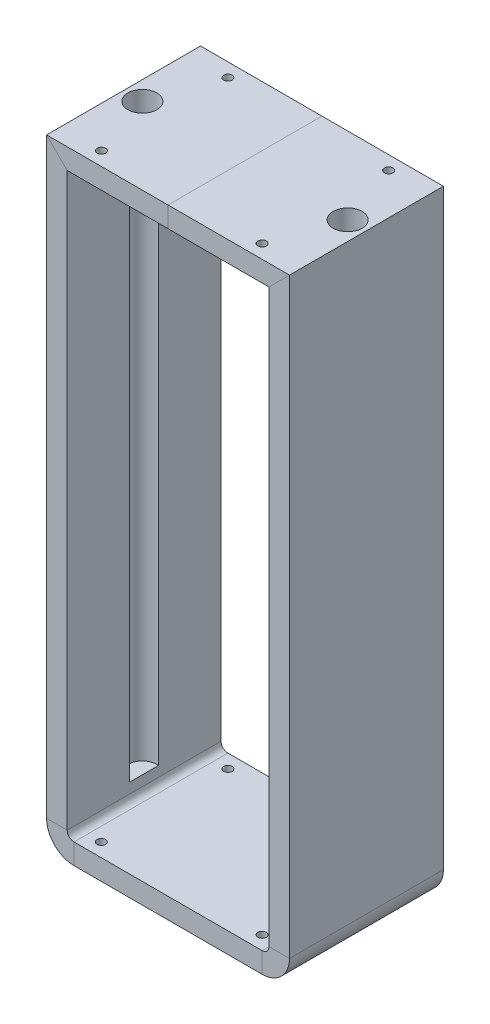
ISO-10303-21;
HEADER;
FILE_DESCRIPTION(('STEP AP214'),'2;1');
FILE_NAME('part.step','',(''),(''),'','','');
FILE_SCHEMA(('AUTOMOTIVE_DESIGN { 1 0 10303 214 1 1 1 1 }'));
ENDSEC;
DATA;
#1=APPLICATION_CONTEXT('core data for automotive mechanical design processes');
#2=APPLICATION_PROTOCOL_DEFINITION('international standard','automotive_design',2000,#1);
#3=PRODUCT_CONTEXT('',#1,'mechanical');
#4=PRODUCT('Part','Part','',(#3));
#5=PRODUCT_RELATED_PRODUCT_CATEGORY('part','',(#4));
#6=PRODUCT_DEFINITION_FORMATION('','',#4);
#7=PRODUCT_DEFINITION_CONTEXT('part definition',#1,'design');
#8=PRODUCT_DEFINITION('design','',#6,#7);
#9=PRODUCT_DEFINITION_SHAPE('','',#8);
#10=(LENGTH_UNIT() NAMED_UNIT(*) SI_UNIT(.MILLI.,.METRE.));
#11=(NAMED_UNIT(*) PLANE_ANGLE_UNIT() SI_UNIT($,.RADIAN.));
#12=(NAMED_UNIT(*) SI_UNIT($,.STERADIAN.) SOLID_ANGLE_UNIT());
#13=UNCERTAINTY_MEASURE_WITH_UNIT(LENGTH_MEASURE(1.E-05),#10,'distance_accuracy_value','');
#14=(GEOMETRIC_REPRESENTATION_CONTEXT(3) GLOBAL_UNCERTAINTY_ASSIGNED_CONTEXT((#13)) GLOBAL_UNIT_ASSIGNED_CONTEXT((#10,
#11,#12)) REPRESENTATION_CONTEXT('',''));
#15=CARTESIAN_POINT('',(0.,0.,0.));
#16=DIRECTION('',(0.,0.,1.));
#17=DIRECTION('',(1.,0.,0.));
#18=AXIS2_PLACEMENT_3D('',#15,#16,#17);
#19=CARTESIAN_POINT('',(-71.6999999999999,356.,44.9999999999999));
#20=DIRECTION('',(0.,0.,1.));
#21=DIRECTION('',(1.,0.,0.));
#22=AXIS2_PLACEMENT_3D('',#19,#20,#21);
#23=PLANE('',#22);
#24=DIRECTION('',(-0.707106781186548,0.707106781186547,0.));
#25=VECTOR('',#24,1.);
#26=CARTESIAN_POINT('',(102.,183.,44.9999999999999));
#27=LINE('',#26,#25);
#28=CARTESIAN_POINT('',(-58.9999999999999,344.,44.9999999999999));
#29=VERTEX_POINT('',#28);
#30=CARTESIAN_POINT('',(-71.,356.,44.9999999999999));
#31=VERTEX_POINT('',#30);
#32=EDGE_CURVE('E349',#29,#31,#27,.T.);
#33=ORIENTED_EDGE('',*,*,#32,.F.);
#34=DIRECTION('',(1.,0.,0.));
#35=VECTOR('',#34,1.);
#36=CARTESIAN_POINT('',(-71.6999999999999,344.,44.9999999999999));
#37=LINE('',#36,#35);
#38=CARTESIAN_POINT('',(0.,344.,44.9999999999999));
#39=VERTEX_POINT('',#38);
#40=EDGE_CURVE('E295',#29,#39,#37,.T.);
#41=ORIENTED_EDGE('',*,*,#40,.T.);
#42=DIRECTION('',(0.,-1.,0.));
#43=VECTOR('',#42,1.);
#44=CARTESIAN_POINT('',(0.,356.,44.9999999999999));
#45=LINE('',#44,#43);
#46=CARTESIAN_POINT('',(0.,356.,44.9999999999999));
#47=VERTEX_POINT('',#46);
#48=EDGE_CURVE('E302',#47,#39,#45,.T.);
#49=ORIENTED_EDGE('',*,*,#48,.F.);
#50=DIRECTION('',(1.,0.,0.));
#51=VECTOR('',#50,1.);
#52=CARTESIAN_POINT('',(-71.6999999999999,356.,44.9999999999999));
#53=LINE('',#52,#51);
#54=EDGE_CURVE('E293',#31,#47,#53,.T.);
#55=ORIENTED_EDGE('',*,*,#54,.F.);
#56=EDGE_LOOP('',(#33,#41,#49,#55));
#57=FACE_BOUND('',#56,.T.);
#58=ADVANCED_FACE('F37',(#57),#23,.T.);
#59=CARTESIAN_POINT('',(-71.6999999999999,344.,-45.0000000000001));
#60=DIRECTION('',(0.,-1.,0.));
#61=DIRECTION('',(0.,0.,-1.));
#62=AXIS2_PLACEMENT_3D('',#59,#60,#61);
#63=PLANE('',#62);
#64=CARTESIAN_POINT('',(-47.,344.,37.));
#65=DIRECTION('',(0.,-1.,0.));
#66=DIRECTION('',(0.,0.,-1.));
#67=AXIS2_PLACEMENT_3D('',#64,#65,#66);
#68=CIRCLE('',#67,2.5);
#69=CARTESIAN_POINT('',(-47.,344.,34.5));
#70=VERTEX_POINT('',#69);
#71=EDGE_CURVE('E296',#70,#70,#68,.T.);
#72=ORIENTED_EDGE('',*,*,#71,.F.);
#73=EDGE_LOOP('',(#72));
#74=FACE_BOUND('',#73,.T.);
#75=CARTESIAN_POINT('',(-60.,344.,0.));
#76=DIRECTION('',(0.,-1.,0.));
#77=DIRECTION('',(0.,0.,-1.));
#78=AXIS2_PLACEMENT_3D('',#75,#76,#77);
#79=CIRCLE('',#78,8.5);
#80=CARTESIAN_POINT('',(-59.,344.,-8.44097150806708));
#81=VERTEX_POINT('',#80);
#82=CARTESIAN_POINT('',(-58.9999999999999,344.,8.44097150806703));
#83=VERTEX_POINT('',#82);
#84=EDGE_CURVE('E190',#81,#83,#79,.T.);
#85=ORIENTED_EDGE('',*,*,#84,.F.);
#86=DIRECTION('',(0.,0.,1.));
#87=VECTOR('',#86,1.);
#88=CARTESIAN_POINT('',(-59.,344.,-44.9999999999999));
#89=LINE('',#88,#87);
#90=CARTESIAN_POINT('',(-59.,344.,-45.0000000000001));
#91=VERTEX_POINT('',#90);
#92=EDGE_CURVE('E341',#91,#81,#89,.T.);
#93=ORIENTED_EDGE('',*,*,#92,.F.);
#94=DIRECTION('',(1.,0.,0.));
#95=VECTOR('',#94,1.);
#96=CARTESIAN_POINT('',(-71.6999999999999,344.,-45.0000000000001));
#97=LINE('',#96,#95);
#98=CARTESIAN_POINT('',(0.,344.,-45.0000000000001));
#99=VERTEX_POINT('',#98);
#100=EDGE_CURVE('E298',#91,#99,#97,.T.);
#101=ORIENTED_EDGE('',*,*,#100,.T.);
#102=DIRECTION('',(0.,0.,-1.));
#103=VECTOR('',#102,1.);
#104=CARTESIAN_POINT('',(0.,344.,-45.0000000000001));
#105=LINE('',#104,#103);
#106=EDGE_CURVE('E305',#39,#99,#105,.T.);
#107=ORIENTED_EDGE('',*,*,#106,.F.);
#108=ORIENTED_EDGE('',*,*,#40,.F.);
#109=EDGE_CURVE('E265',#83,#29,#89,.T.);
#110=ORIENTED_EDGE('',*,*,#109,.F.);
#111=EDGE_LOOP('',(#85,#93,#101,#107,#108,#110));
#112=FACE_BOUND('',#111,.T.);
#113=CARTESIAN_POINT('',(-47.,344.,-37.));
#114=DIRECTION('',(0.,-1.,0.));
#115=DIRECTION('',(0.,0.,-1.));
#116=AXIS2_PLACEMENT_3D('',#113,#114,#115);
#117=CIRCLE('',#116,2.5);
#118=CARTESIAN_POINT('',(-47.,344.,-39.5));
#119=VERTEX_POINT('',#118);
#120=EDGE_CURVE('E434',#119,#119,#117,.T.);
#121=ORIENTED_EDGE('',*,*,#120,.F.);
#122=EDGE_LOOP('',(#121));
#123=FACE_BOUND('',#122,.T.);
#124=ADVANCED_FACE('F230',(#74,#112,#123),#63,.T.);
#125=CARTESIAN_POINT('',(-71.6999999999999,356.,-45.0000000000001));
#126=DIRECTION('',(0.,0.,-1.));
#127=DIRECTION('',(0.,1.,0.));
#128=AXIS2_PLACEMENT_3D('',#125,#126,#127);
#129=PLANE('',#128);
#130=DIRECTION('',(0.707106781186548,-0.707106781186547,0.));
#131=VECTOR('',#130,1.);
#132=CARTESIAN_POINT('',(102.,183.,-45.0000000000001));
#133=LINE('',#132,#131);
#134=CARTESIAN_POINT('',(-71.,356.,-45.0000000000001));
#135=VERTEX_POINT('',#134);
#136=EDGE_CURVE('E343',#135,#91,#133,.T.);
#137=ORIENTED_EDGE('',*,*,#136,.F.);
#138=DIRECTION('',(1.,0.,0.));
#139=VECTOR('',#138,1.);
#140=CARTESIAN_POINT('',(-71.6999999999999,356.,-45.0000000000001));
#141=LINE('',#140,#139);
#142=CARTESIAN_POINT('',(0.,356.,-45.0000000000001));
#143=VERTEX_POINT('',#142);
#144=EDGE_CURVE('E300',#135,#143,#141,.T.);
#145=ORIENTED_EDGE('',*,*,#144,.T.);
#146=DIRECTION('',(0.,1.,0.));
#147=VECTOR('',#146,1.);
#148=CARTESIAN_POINT('',(0.,356.,-45.0000000000001));
#149=LINE('',#148,#147);
#150=EDGE_CURVE('E261',#99,#143,#149,.T.);
#151=ORIENTED_EDGE('',*,*,#150,.F.);
#152=ORIENTED_EDGE('',*,*,#100,.F.);
#153=EDGE_LOOP('',(#137,#145,#151,#152));
#154=FACE_BOUND('',#153,.T.);
#155=ADVANCED_FACE('F226',(#154),#129,.T.);
#156=CARTESIAN_POINT('',(-71.6999999999999,356.,-45.0000000000001));
#157=DIRECTION('',(0.,1.,0.));
#158=DIRECTION('',(0.,0.,1.));
#159=AXIS2_PLACEMENT_3D('',#156,#157,#158);
#160=PLANE('',#159);
#161=CARTESIAN_POINT('',(-47.,356.,37.));
#162=DIRECTION('',(0.,1.,0.));
#163=DIRECTION('',(0.,0.,1.));
#164=AXIS2_PLACEMENT_3D('',#161,#162,#163);
#165=CIRCLE('',#164,2.5);
#166=CARTESIAN_POINT('',(-47.,356.,39.5));
#167=VERTEX_POINT('',#166);
#168=EDGE_CURVE('E448',#167,#167,#165,.T.);
#169=ORIENTED_EDGE('',*,*,#168,.F.);
#170=EDGE_LOOP('',(#169));
#171=FACE_BOUND('',#170,.T.);
#172=CARTESIAN_POINT('',(-60.,356.,0.));
#173=DIRECTION('',(0.,1.,0.));
#174=DIRECTION('',(0.,0.,-1.));
#175=AXIS2_PLACEMENT_3D('',#172,#173,#174);
#176=CIRCLE('',#175,8.5);
#177=CARTESIAN_POINT('',(-60.,356.,-8.50000000000002));
#178=VERTEX_POINT('',#177);
#179=EDGE_CURVE('E452',#178,#178,#176,.T.);
#180=ORIENTED_EDGE('',*,*,#179,.F.);
#181=EDGE_LOOP('',(#180));
#182=FACE_BOUND('',#181,.T.);
#183=CARTESIAN_POINT('',(-47.,356.,-37.));
#184=DIRECTION('',(0.,1.,0.));
#185=DIRECTION('',(0.,0.,-1.));
#186=AXIS2_PLACEMENT_3D('',#183,#184,#185);
#187=CIRCLE('',#186,2.5);
#188=CARTESIAN_POINT('',(-47.,356.,-39.5));
#189=VERTEX_POINT('',#188);
#190=EDGE_CURVE('E456',#189,#189,#187,.T.);
#191=ORIENTED_EDGE('',*,*,#190,.F.);
#192=EDGE_LOOP('',(#191));
#193=FACE_BOUND('',#192,.T.);
#194=DIRECTION('',(0.,0.,-1.));
#195=VECTOR('',#194,1.);
#196=CARTESIAN_POINT('',(-71.,356.,-45.0000000000001));
#197=LINE('',#196,#195);
#198=EDGE_CURVE('E346',#31,#135,#197,.T.);
#199=ORIENTED_EDGE('',*,*,#198,.F.);
#200=ORIENTED_EDGE('',*,*,#54,.T.);
#201=DIRECTION('',(0.,0.,1.));
#202=VECTOR('',#201,1.);
#203=CARTESIAN_POINT('',(0.,356.,-45.0000000000001));
#204=LINE('',#203,#202);
#205=EDGE_CURVE('E309',#143,#47,#204,.T.);
#206=ORIENTED_EDGE('',*,*,#205,.F.);
#207=ORIENTED_EDGE('',*,*,#144,.F.);
#208=EDGE_LOOP('',(#199,#200,#206,#207));
#209=FACE_BOUND('',#208,.T.);
#210=ADVANCED_FACE('F222',(#171,#182,#193,#209),#160,.T.);
#211=CARTESIAN_POINT('',(0.,356.,44.9999999999999));
#212=DIRECTION('',(0.,0.,1.));
#213=DIRECTION('',(1.,0.,0.));
#214=AXIS2_PLACEMENT_3D('',#211,#212,#213);
#215=PLANE('',#214);
#216=DIRECTION('',(1.,0.,0.));
#217=VECTOR('',#216,1.);
#218=CARTESIAN_POINT('',(0.,344.,44.9999999999999));
#219=LINE('',#218,#217);
#220=CARTESIAN_POINT('',(58.9999999999999,344.,44.9999999999999));
#221=VERTEX_POINT('',#220);
#222=EDGE_CURVE('E314',#39,#221,#219,.T.);
#223=ORIENTED_EDGE('',*,*,#222,.T.);
#224=DIRECTION('',(0.707106781186548,0.707106781186548,0.));
#225=VECTOR('',#224,1.);
#226=CARTESIAN_POINT('',(71.3499999999999,356.35,44.9999999999999));
#227=LINE('',#226,#225);
#228=CARTESIAN_POINT('',(70.9999999999999,356.,44.9999999999999));
#229=VERTEX_POINT('',#228);
#230=EDGE_CURVE('E325',#221,#229,#227,.T.);
#231=ORIENTED_EDGE('',*,*,#230,.T.);
#232=DIRECTION('',(1.,0.,0.));
#233=VECTOR('',#232,1.);
#234=CARTESIAN_POINT('',(0.,356.,44.9999999999999));
#235=LINE('',#234,#233);
#236=EDGE_CURVE('E311',#47,#229,#235,.T.);
#237=ORIENTED_EDGE('',*,*,#236,.F.);
#238=ORIENTED_EDGE('',*,*,#48,.T.);
#239=EDGE_LOOP('',(#223,#231,#237,#238));
#240=FACE_BOUND('',#239,.T.);
#241=ADVANCED_FACE('F225',(#240),#215,.T.);
#242=CARTESIAN_POINT('',(0.,344.,-45.0000000000001));
#243=DIRECTION('',(0.,-1.,0.));
#244=DIRECTION('',(0.,0.,-1.));
#245=AXIS2_PLACEMENT_3D('',#242,#243,#244);
#246=PLANE('',#245);
#247=CARTESIAN_POINT('',(60.,344.,0.));
#248=DIRECTION('',(0.,-1.,0.));
#249=DIRECTION('',(0.,0.,-1.));
#250=AXIS2_PLACEMENT_3D('',#247,#248,#249);
#251=CIRCLE('',#250,8.50000000000001);
#252=CARTESIAN_POINT('',(59.,344.,8.44097150806705));
#253=VERTEX_POINT('',#252);
#254=CARTESIAN_POINT('',(59.,344.,-8.4409715080671));
#255=VERTEX_POINT('',#254);
#256=EDGE_CURVE('E172',#253,#255,#251,.T.);
#257=ORIENTED_EDGE('',*,*,#256,.F.);
#258=DIRECTION('',(0.,0.,1.));
#259=VECTOR('',#258,1.);
#260=CARTESIAN_POINT('',(59.,344.,-45.0000000000001));
#261=LINE('',#260,#259);
#262=EDGE_CURVE('E178',#253,#221,#261,.T.);
#263=ORIENTED_EDGE('',*,*,#262,.T.);
#264=ORIENTED_EDGE('',*,*,#222,.F.);
#265=ORIENTED_EDGE('',*,*,#106,.T.);
#266=DIRECTION('',(1.,0.,0.));
#267=VECTOR('',#266,1.);
#268=CARTESIAN_POINT('',(0.,344.,-45.0000000000001));
#269=LINE('',#268,#267);
#270=CARTESIAN_POINT('',(59.,344.,-45.0000000000001));
#271=VERTEX_POINT('',#270);
#272=EDGE_CURVE('E266',#99,#271,#269,.T.);
#273=ORIENTED_EDGE('',*,*,#272,.T.);
#274=EDGE_CURVE('E275',#271,#255,#261,.T.);
#275=ORIENTED_EDGE('',*,*,#274,.T.);
#276=EDGE_LOOP('',(#257,#263,#264,#265,#273,#275));
#277=FACE_BOUND('',#276,.T.);
#278=CARTESIAN_POINT('',(47.,344.,-37.));
#279=DIRECTION('',(0.,-1.,0.));
#280=DIRECTION('',(0.,0.,-1.));
#281=AXIS2_PLACEMENT_3D('',#278,#279,#280);
#282=CIRCLE('',#281,2.5);
#283=CARTESIAN_POINT('',(47.,344.,-39.5));
#284=VERTEX_POINT('',#283);
#285=EDGE_CURVE('E437',#284,#284,#282,.T.);
#286=ORIENTED_EDGE('',*,*,#285,.F.);
#287=EDGE_LOOP('',(#286));
#288=FACE_BOUND('',#287,.T.);
#289=CARTESIAN_POINT('',(47.,344.,37.));
#290=DIRECTION('',(0.,-1.,0.));
#291=DIRECTION('',(0.,0.,-1.));
#292=AXIS2_PLACEMENT_3D('',#289,#290,#291);
#293=CIRCLE('',#292,2.5);
#294=CARTESIAN_POINT('',(47.,344.,34.5));
#295=VERTEX_POINT('',#294);
#296=EDGE_CURVE('E440',#295,#295,#293,.T.);
#297=ORIENTED_EDGE('',*,*,#296,.F.);
#298=EDGE_LOOP('',(#297));
#299=FACE_BOUND('',#298,.T.);
#300=ADVANCED_FACE('F240',(#277,#288,#299),#246,.T.);
#301=CARTESIAN_POINT('',(0.,356.,-45.0000000000001));
#302=DIRECTION('',(0.,0.,-1.));
#303=DIRECTION('',(0.,1.,0.));
#304=AXIS2_PLACEMENT_3D('',#301,#302,#303);
#305=PLANE('',#304);
#306=DIRECTION('',(1.,0.,0.));
#307=VECTOR('',#306,1.);
#308=CARTESIAN_POINT('',(0.,356.,-45.0000000000001));
#309=LINE('',#308,#307);
#310=CARTESIAN_POINT('',(70.9999999999999,356.,-45.0000000000001));
#311=VERTEX_POINT('',#310);
#312=EDGE_CURVE('E255',#143,#311,#309,.T.);
#313=ORIENTED_EDGE('',*,*,#312,.T.);
#314=DIRECTION('',(-0.707106781186548,-0.707106781186548,0.));
#315=VECTOR('',#314,1.);
#316=CARTESIAN_POINT('',(71.3499999999999,356.35,-45.0000000000001));
#317=LINE('',#316,#315);
#318=EDGE_CURVE('E258',#311,#271,#317,.T.);
#319=ORIENTED_EDGE('',*,*,#318,.T.);
#320=ORIENTED_EDGE('',*,*,#272,.F.);
#321=ORIENTED_EDGE('',*,*,#150,.T.);
#322=EDGE_LOOP('',(#313,#319,#320,#321));
#323=FACE_BOUND('',#322,.T.);
#324=ADVANCED_FACE('F243',(#323),#305,.T.);
#325=CARTESIAN_POINT('',(0.,356.,-45.0000000000001));
#326=DIRECTION('',(0.,1.,0.));
#327=DIRECTION('',(0.,0.,1.));
#328=AXIS2_PLACEMENT_3D('',#325,#326,#327);
#329=PLANE('',#328);
#330=CARTESIAN_POINT('',(60.,356.,0.));
#331=DIRECTION('',(0.,1.,0.));
#332=DIRECTION('',(0.,0.,1.));
#333=AXIS2_PLACEMENT_3D('',#330,#331,#332);
#334=CIRCLE('',#333,8.50000000000001);
#335=CARTESIAN_POINT('',(60.,356.,8.49999999999999));
#336=VERTEX_POINT('',#335);
#337=EDGE_CURVE('E173',#336,#336,#334,.T.);
#338=ORIENTED_EDGE('',*,*,#337,.F.);
#339=EDGE_LOOP('',(#338));
#340=FACE_BOUND('',#339,.T.);
#341=CARTESIAN_POINT('',(47.,356.,-37.));
#342=DIRECTION('',(0.,1.,0.));
#343=DIRECTION('',(0.,0.,1.));
#344=AXIS2_PLACEMENT_3D('',#341,#342,#343);
#345=CIRCLE('',#344,2.5);
#346=CARTESIAN_POINT('',(47.,356.,-34.5));
#347=VERTEX_POINT('',#346);
#348=EDGE_CURVE('E449',#347,#347,#345,.T.);
#349=ORIENTED_EDGE('',*,*,#348,.F.);
#350=EDGE_LOOP('',(#349));
#351=FACE_BOUND('',#350,.T.);
#352=CARTESIAN_POINT('',(47.,356.,37.));
#353=DIRECTION('',(0.,1.,0.));
#354=DIRECTION('',(0.,0.,-1.));
#355=AXIS2_PLACEMENT_3D('',#352,#353,#354);
#356=CIRCLE('',#355,2.5);
#357=CARTESIAN_POINT('',(47.,356.,34.5));
#358=VERTEX_POINT('',#357);
#359=EDGE_CURVE('E445',#358,#358,#356,.T.);
#360=ORIENTED_EDGE('',*,*,#359,.F.);
#361=EDGE_LOOP('',(#360));
#362=FACE_BOUND('',#361,.T.);
#363=ORIENTED_EDGE('',*,*,#236,.T.);
#364=DIRECTION('',(0.,0.,-1.));
#365=VECTOR('',#364,1.);
#366=CARTESIAN_POINT('',(71.,356.,-45.0000000000001));
#367=LINE('',#366,#365);
#368=EDGE_CURVE('E281',#229,#311,#367,.T.);
#369=ORIENTED_EDGE('',*,*,#368,.T.);
#370=ORIENTED_EDGE('',*,*,#312,.F.);
#371=ORIENTED_EDGE('',*,*,#205,.T.);
#372=EDGE_LOOP('',(#363,#369,#370,#371));
#373=FACE_BOUND('',#372,.T.);
#374=ADVANCED_FACE('F39',(#340,#351,#362,#373),#329,.T.);
#375=CARTESIAN_POINT('',(71.,10.,44.9999999999999));
#376=DIRECTION('',(0.,0.,1.));
#377=DIRECTION('',(1.,0.,0.));
#378=AXIS2_PLACEMENT_3D('',#375,#376,#377);
#379=PLANE('',#378);
#380=CARTESIAN_POINT('',(55.,10.,44.9999999999999));
#381=DIRECTION('',(0.,0.,-1.));
#382=DIRECTION('',(1.,0.,0.));
#383=AXIS2_PLACEMENT_3D('',#380,#381,#382);
#384=CIRCLE('',#383,3.99999999999994);
#385=CARTESIAN_POINT('',(58.9999999999999,10.,44.9999999999999));
#386=VERTEX_POINT('',#385);
#387=CARTESIAN_POINT('',(55.,6.00000000000006,44.9999999999999));
#388=VERTEX_POINT('',#387);
#389=EDGE_CURVE('E406',#386,#388,#384,.T.);
#390=ORIENTED_EDGE('',*,*,#389,.T.);
#391=DIRECTION('',(0.,1.,0.));
#392=VECTOR('',#391,1.);
#393=CARTESIAN_POINT('',(54.9999999999999,-5.99999999999995,44.9999999999999));
#394=LINE('',#393,#392);
#395=CARTESIAN_POINT('',(54.9999999999999,-5.99999999999995,44.9999999999999));
#396=VERTEX_POINT('',#395);
#397=EDGE_CURVE('E425',#396,#388,#394,.T.);
#398=ORIENTED_EDGE('',*,*,#397,.F.);
#399=CARTESIAN_POINT('',(55.,10.,44.9999999999999));
#400=DIRECTION('',(0.,0.,-1.));
#401=DIRECTION('',(1.,0.,0.));
#402=AXIS2_PLACEMENT_3D('',#399,#400,#401);
#403=CIRCLE('',#402,16.);
#404=CARTESIAN_POINT('',(71.,10.,44.9999999999999));
#405=VERTEX_POINT('',#404);
#406=EDGE_CURVE('E367',#405,#396,#403,.T.);
#407=ORIENTED_EDGE('',*,*,#406,.F.);
#408=DIRECTION('',(-1.,0.,0.));
#409=VECTOR('',#408,1.);
#410=CARTESIAN_POINT('',(71.,10.,44.9999999999999));
#411=LINE('',#410,#409);
#412=EDGE_CURVE('E352',#405,#386,#411,.T.);
#413=ORIENTED_EDGE('',*,*,#412,.T.);
#414=EDGE_LOOP('',(#390,#398,#407,#413));
#415=FACE_BOUND('',#414,.T.);
#416=ADVANCED_FACE('F250',(#415),#379,.T.);
#417=CARTESIAN_POINT('',(55.,10.,0.));
#418=DIRECTION('',(0.,0.,-1.));
#419=DIRECTION('',(-1.,0.,0.));
#420=AXIS2_PLACEMENT_3D('',#417,#418,#419);
#421=CYLINDRICAL_SURFACE('',#420,3.99999999999997);
#422=CARTESIAN_POINT('',(55.,10.,-45.0000000000001));
#423=DIRECTION('',(0.,0.,-1.));
#424=DIRECTION('',(1.,0.,0.));
#425=AXIS2_PLACEMENT_3D('',#422,#423,#424);
#426=CIRCLE('',#425,4.);
#427=CARTESIAN_POINT('',(59.,10.,-45.0000000000001));
#428=VERTEX_POINT('',#427);
#429=CARTESIAN_POINT('',(55.,6.,-45.0000000000001));
#430=VERTEX_POINT('',#429);
#431=EDGE_CURVE('E386',#428,#430,#426,.T.);
#432=ORIENTED_EDGE('',*,*,#431,.T.);
#433=DIRECTION('',(0.,0.,-1.));
#434=VECTOR('',#433,1.);
#435=CARTESIAN_POINT('',(55.,6.00000000000001,-45.0000000000001));
#436=LINE('',#435,#434);
#437=EDGE_CURVE('E403',#388,#430,#436,.T.);
#438=ORIENTED_EDGE('',*,*,#437,.F.);
#439=ORIENTED_EDGE('',*,*,#389,.F.);
#440=DIRECTION('',(0.,0.,-1.));
#441=VECTOR('',#440,1.);
#442=CARTESIAN_POINT('',(59.,10.,-45.0000000000001));
#443=LINE('',#442,#441);
#444=EDGE_CURVE('E388',#386,#428,#443,.T.);
#445=ORIENTED_EDGE('',*,*,#444,.T.);
#446=EDGE_LOOP('',(#432,#438,#439,#445));
#447=FACE_BOUND('',#446,.T.);
#448=ADVANCED_FACE('F555',(#447),#421,.F.);
#449=CARTESIAN_POINT('',(71.,10.,-45.0000000000001));
#450=DIRECTION('',(0.,0.,-1.));
#451=DIRECTION('',(-1.,0.,0.));
#452=AXIS2_PLACEMENT_3D('',#449,#450,#451);
#453=PLANE('',#452);
#454=CARTESIAN_POINT('',(55.,10.,-45.0000000000001));
#455=DIRECTION('',(0.,0.,-1.));
#456=DIRECTION('',(1.,0.,0.));
#457=AXIS2_PLACEMENT_3D('',#454,#455,#456);
#458=CIRCLE('',#457,16.);
#459=CARTESIAN_POINT('',(71.,10.,-45.0000000000001));
#460=VERTEX_POINT('',#459);
#461=CARTESIAN_POINT('',(54.9999999999999,-5.99999999999995,-45.0000000000001));
#462=VERTEX_POINT('',#461);
#463=EDGE_CURVE('E365',#460,#462,#458,.T.);
#464=ORIENTED_EDGE('',*,*,#463,.T.);
#465=DIRECTION('',(0.,-1.,0.));
#466=VECTOR('',#465,1.);
#467=CARTESIAN_POINT('',(54.9999999999999,-5.99999999999995,-45.0000000000001));
#468=LINE('',#467,#466);
#469=EDGE_CURVE('E383',#430,#462,#468,.T.);
#470=ORIENTED_EDGE('',*,*,#469,.F.);
#471=ORIENTED_EDGE('',*,*,#431,.F.);
#472=DIRECTION('',(1.,0.,0.));
#473=VECTOR('',#472,1.);
#474=CARTESIAN_POINT('',(71.,10.,-45.0000000000001));
#475=LINE('',#474,#473);
#476=EDGE_CURVE('E368',#428,#460,#475,.T.);
#477=ORIENTED_EDGE('',*,*,#476,.T.);
#478=EDGE_LOOP('',(#464,#470,#471,#477));
#479=FACE_BOUND('',#478,.T.);
#480=ADVANCED_FACE('F551',(#479),#453,.T.);
#481=CARTESIAN_POINT('',(55.,10.,0.));
#482=DIRECTION('',(0.,0.,-1.));
#483=DIRECTION('',(-1.,0.,0.));
#484=AXIS2_PLACEMENT_3D('',#481,#482,#483);
#485=CYLINDRICAL_SURFACE('',#484,16.);
#486=DIRECTION('',(0.,0.,1.));
#487=VECTOR('',#486,1.);
#488=CARTESIAN_POINT('',(54.9999999999999,-5.99999999999995,-45.0000000000001));
#489=LINE('',#488,#487);
#490=EDGE_CURVE('E361',#462,#396,#489,.T.);
#491=ORIENTED_EDGE('',*,*,#490,.F.);
#492=ORIENTED_EDGE('',*,*,#463,.F.);
#493=DIRECTION('',(0.,0.,1.));
#494=VECTOR('',#493,1.);
#495=CARTESIAN_POINT('',(71.,10.,-45.0000000000001));
#496=LINE('',#495,#494);
#497=EDGE_CURVE('E284',#460,#405,#496,.T.);
#498=ORIENTED_EDGE('',*,*,#497,.T.);
#499=ORIENTED_EDGE('',*,*,#406,.T.);
#500=EDGE_LOOP('',(#491,#492,#498,#499));
#501=FACE_BOUND('',#500,.T.);
#502=ADVANCED_FACE('F549',(#501),#485,.T.);
#503=CARTESIAN_POINT('',(54.9999999999999,-5.99999999999995,44.9999999999999));
#504=DIRECTION('',(0.,0.,1.));
#505=DIRECTION('',(1.,0.,0.));
#506=AXIS2_PLACEMENT_3D('',#503,#504,#505);
#507=PLANE('',#506);
#508=DIRECTION('',(-1.,0.,0.));
#509=VECTOR('',#508,1.);
#510=CARTESIAN_POINT('',(54.9999999999999,6.00000000000006,44.9999999999999));
#511=LINE('',#510,#509);
#512=CARTESIAN_POINT('',(-54.9999999999999,6.00000000000006,44.9999999999999));
#513=VERTEX_POINT('',#512);
#514=EDGE_CURVE('E400',#388,#513,#511,.T.);
#515=ORIENTED_EDGE('',*,*,#514,.T.);
#516=DIRECTION('',(0.,1.,0.));
#517=VECTOR('',#516,1.);
#518=CARTESIAN_POINT('',(-55.,-5.99999999999995,44.9999999999999));
#519=LINE('',#518,#517);
#520=CARTESIAN_POINT('',(-54.9999999999999,-5.99999999999995,44.9999999999999));
#521=VERTEX_POINT('',#520);
#522=EDGE_CURVE('E418',#521,#513,#519,.T.);
#523=ORIENTED_EDGE('',*,*,#522,.F.);
#524=DIRECTION('',(-1.,0.,0.));
#525=VECTOR('',#524,1.);
#526=CARTESIAN_POINT('',(54.9999999999999,-5.99999999999995,44.9999999999999));
#527=LINE('',#526,#525);
#528=EDGE_CURVE('E364',#396,#521,#527,.T.);
#529=ORIENTED_EDGE('',*,*,#528,.F.);
#530=ORIENTED_EDGE('',*,*,#397,.T.);
#531=EDGE_LOOP('',(#515,#523,#529,#530));
#532=FACE_BOUND('',#531,.T.);
#533=ADVANCED_FACE('F501',(#532),#507,.T.);
#534=CARTESIAN_POINT('',(54.9999999999999,6.00000000000001,-45.0000000000001));
#535=DIRECTION('',(0.,1.,0.));
#536=DIRECTION('',(0.,0.,1.));
#537=AXIS2_PLACEMENT_3D('',#534,#535,#536);
#538=PLANE('',#537);
#539=CARTESIAN_POINT('',(47.,6.00000000000006,36.9999999999998));
#540=DIRECTION('',(0.,1.,0.));
#541=DIRECTION('',(0.,0.,-1.));
#542=AXIS2_PLACEMENT_3D('',#539,#540,#541);
#543=CIRCLE('',#542,2.49999999999999);
#544=CARTESIAN_POINT('',(47.,6.00000000000005,34.4999999999998));
#545=VERTEX_POINT('',#544);
#546=EDGE_CURVE('E470',#545,#545,#543,.T.);
#547=ORIENTED_EDGE('',*,*,#546,.F.);
#548=EDGE_LOOP('',(#547));
#549=FACE_BOUND('',#548,.T.);
#550=CARTESIAN_POINT('',(-47.,6.00000000000006,36.9999999999998));
#551=DIRECTION('',(0.,1.,0.));
#552=DIRECTION('',(0.,0.,1.));
#553=AXIS2_PLACEMENT_3D('',#550,#551,#552);
#554=CIRCLE('',#553,2.49999999999999);
#555=CARTESIAN_POINT('',(-47.,6.00000000000006,39.4999999999998));
#556=VERTEX_POINT('',#555);
#557=EDGE_CURVE('E476',#556,#556,#554,.T.);
#558=ORIENTED_EDGE('',*,*,#557,.F.);
#559=EDGE_LOOP('',(#558));
#560=FACE_BOUND('',#559,.T.);
#561=CARTESIAN_POINT('',(-47.,6.00000000000001,-36.9999999999998));
#562=DIRECTION('',(0.,1.,0.));
#563=DIRECTION('',(0.,0.,-1.));
#564=AXIS2_PLACEMENT_3D('',#561,#562,#563);
#565=CIRCLE('',#564,2.49999999999999);
#566=CARTESIAN_POINT('',(-47.,6.00000000000001,-39.4999999999998));
#567=VERTEX_POINT('',#566);
#568=EDGE_CURVE('E482',#567,#567,#565,.T.);
#569=ORIENTED_EDGE('',*,*,#568,.F.);
#570=EDGE_LOOP('',(#569));
#571=FACE_BOUND('',#570,.T.);
#572=CARTESIAN_POINT('',(47.,6.00000000000001,-36.9999999999998));
#573=DIRECTION('',(0.,1.,0.));
#574=DIRECTION('',(0.,0.,1.));
#575=AXIS2_PLACEMENT_3D('',#572,#573,#574);
#576=CIRCLE('',#575,2.49999999999999);
#577=CARTESIAN_POINT('',(47.,6.00000000000001,-34.4999999999998));
#578=VERTEX_POINT('',#577);
#579=EDGE_CURVE('E464',#578,#578,#576,.T.);
#580=ORIENTED_EDGE('',*,*,#579,.F.);
#581=EDGE_LOOP('',(#580));
#582=FACE_BOUND('',#581,.T.);
#583=DIRECTION('',(-1.,0.,0.));
#584=VECTOR('',#583,1.);
#585=CARTESIAN_POINT('',(54.9999999999999,6.00000000000001,-45.0000000000001));
#586=LINE('',#585,#584);
#587=CARTESIAN_POINT('',(-54.9999999999999,6.00000000000001,-45.0000000000001));
#588=VERTEX_POINT('',#587);
#589=EDGE_CURVE('E380',#430,#588,#586,.T.);
#590=ORIENTED_EDGE('',*,*,#589,.T.);
#591=DIRECTION('',(0.,0.,-1.));
#592=VECTOR('',#591,1.);
#593=CARTESIAN_POINT('',(-55.,6.00000000000001,-45.0000000000001));
#594=LINE('',#593,#592);
#595=EDGE_CURVE('E397',#513,#588,#594,.T.);
#596=ORIENTED_EDGE('',*,*,#595,.F.);
#597=ORIENTED_EDGE('',*,*,#514,.F.);
#598=ORIENTED_EDGE('',*,*,#437,.T.);
#599=EDGE_LOOP('',(#590,#596,#597,#598));
#600=FACE_BOUND('',#599,.T.);
#601=ADVANCED_FACE('F497',(#549,#560,#571,#582,#600),#538,.T.);
#602=CARTESIAN_POINT('',(54.9999999999999,-5.99999999999995,-45.0000000000001));
#603=DIRECTION('',(0.,0.,-1.));
#604=DIRECTION('',(0.,1.,0.));
#605=AXIS2_PLACEMENT_3D('',#602,#603,#604);
#606=PLANE('',#605);
#607=DIRECTION('',(-1.,0.,0.));
#608=VECTOR('',#607,1.);
#609=CARTESIAN_POINT('',(54.9999999999999,-5.99999999999995,-45.0000000000001));
#610=LINE('',#609,#608);
#611=CARTESIAN_POINT('',(-54.9999999999999,-5.99999999999995,-45.0000000000001));
#612=VERTEX_POINT('',#611);
#613=EDGE_CURVE('E360',#462,#612,#610,.T.);
#614=ORIENTED_EDGE('',*,*,#613,.T.);
#615=DIRECTION('',(0.,-1.,0.));
#616=VECTOR('',#615,1.);
#617=CARTESIAN_POINT('',(-55.,-5.99999999999995,-45.0000000000001));
#618=LINE('',#617,#616);
#619=EDGE_CURVE('E377',#588,#612,#618,.T.);
#620=ORIENTED_EDGE('',*,*,#619,.F.);
#621=ORIENTED_EDGE('',*,*,#589,.F.);
#622=ORIENTED_EDGE('',*,*,#469,.T.);
#623=EDGE_LOOP('',(#614,#620,#621,#622));
#624=FACE_BOUND('',#623,.T.);
#625=ADVANCED_FACE('F500',(#624),#606,.T.);
#626=CARTESIAN_POINT('',(54.9999999999999,-5.99999999999995,-45.0000000000001));
#627=DIRECTION('',(0.,-1.,0.));
#628=DIRECTION('',(0.,0.,-1.));
#629=AXIS2_PLACEMENT_3D('',#626,#627,#628);
#630=PLANE('',#629);
#631=DIRECTION('',(0.,0.,1.));
#632=VECTOR('',#631,1.);
#633=CARTESIAN_POINT('',(-55.,-5.99999999999995,-45.0000000000001));
#634=LINE('',#633,#632);
#635=EDGE_CURVE('E356',#612,#521,#634,.T.);
#636=ORIENTED_EDGE('',*,*,#635,.F.);
#637=ORIENTED_EDGE('',*,*,#613,.F.);
#638=ORIENTED_EDGE('',*,*,#490,.T.);
#639=ORIENTED_EDGE('',*,*,#528,.T.);
#640=EDGE_LOOP('',(#636,#637,#638,#639));
#641=FACE_BOUND('',#640,.T.);
#642=ADVANCED_FACE('F553',(#641),#630,.T.);
#643=CARTESIAN_POINT('',(-55.,-5.99999999999995,44.9999999999999));
#644=DIRECTION('',(0.,0.,1.));
#645=DIRECTION('',(1.,0.,0.));
#646=AXIS2_PLACEMENT_3D('',#643,#644,#645);
#647=PLANE('',#646);
#648=CARTESIAN_POINT('',(-55.,10.,44.9999999999999));
#649=DIRECTION('',(0.,0.,-1.));
#650=DIRECTION('',(0.,-1.,0.));
#651=AXIS2_PLACEMENT_3D('',#648,#649,#650);
#652=CIRCLE('',#651,3.99999999999995);
#653=CARTESIAN_POINT('',(-58.9999999999999,10.,44.9999999999999));
#654=VERTEX_POINT('',#653);
#655=EDGE_CURVE('E394',#513,#654,#652,.T.);
#656=ORIENTED_EDGE('',*,*,#655,.T.);
#657=DIRECTION('',(1.,0.,0.));
#658=VECTOR('',#657,1.);
#659=CARTESIAN_POINT('',(-70.9999999999999,10.,44.9999999999999));
#660=LINE('',#659,#658);
#661=CARTESIAN_POINT('',(-70.9999999999999,10.,44.9999999999999));
#662=VERTEX_POINT('',#661);
#663=EDGE_CURVE('E411',#662,#654,#660,.T.);
#664=ORIENTED_EDGE('',*,*,#663,.F.);
#665=CARTESIAN_POINT('',(-55.,10.,44.9999999999999));
#666=DIRECTION('',(0.,0.,-1.));
#667=DIRECTION('',(0.,-1.,0.));
#668=AXIS2_PLACEMENT_3D('',#665,#666,#667);
#669=CIRCLE('',#668,16.);
#670=EDGE_CURVE('E359',#521,#662,#669,.T.);
#671=ORIENTED_EDGE('',*,*,#670,.F.);
#672=ORIENTED_EDGE('',*,*,#522,.T.);
#673=EDGE_LOOP('',(#656,#664,#671,#672));
#674=FACE_BOUND('',#673,.T.);
#675=ADVANCED_FACE('F516',(#674),#647,.T.);
#676=CARTESIAN_POINT('',(-55.,10.,0.));
#677=DIRECTION('',(0.,0.,-1.));
#678=DIRECTION('',(-1.,0.,0.));
#679=AXIS2_PLACEMENT_3D('',#676,#677,#678);
#680=CYLINDRICAL_SURFACE('',#679,3.99999999999998);
#681=CARTESIAN_POINT('',(-55.,10.,-45.0000000000001));
#682=DIRECTION('',(0.,0.,-1.));
#683=DIRECTION('',(0.,-1.,0.));
#684=AXIS2_PLACEMENT_3D('',#681,#682,#683);
#685=CIRCLE('',#684,4.);
#686=CARTESIAN_POINT('',(-59.,10.,-45.0000000000001));
#687=VERTEX_POINT('',#686);
#688=EDGE_CURVE('E374',#588,#687,#685,.T.);
#689=ORIENTED_EDGE('',*,*,#688,.T.);
#690=DIRECTION('',(0.,0.,-1.));
#691=VECTOR('',#690,1.);
#692=CARTESIAN_POINT('',(-58.9999999999999,10.,-45.0000000000001));
#693=LINE('',#692,#691);
#694=EDGE_CURVE('E391',#654,#687,#693,.T.);
#695=ORIENTED_EDGE('',*,*,#694,.F.);
#696=ORIENTED_EDGE('',*,*,#655,.F.);
#697=ORIENTED_EDGE('',*,*,#595,.T.);
#698=EDGE_LOOP('',(#689,#695,#696,#697));
#699=FACE_BOUND('',#698,.T.);
#700=ADVANCED_FACE('F512',(#699),#680,.F.);
#701=CARTESIAN_POINT('',(-55.,-5.99999999999995,-45.0000000000001));
#702=DIRECTION('',(0.,0.,-1.));
#703=DIRECTION('',(-1.,0.,0.));
#704=AXIS2_PLACEMENT_3D('',#701,#702,#703);
#705=PLANE('',#704);
#706=CARTESIAN_POINT('',(-55.,10.,-45.0000000000001));
#707=DIRECTION('',(0.,0.,-1.));
#708=DIRECTION('',(0.,-1.,0.));
#709=AXIS2_PLACEMENT_3D('',#706,#707,#708);
#710=CIRCLE('',#709,16.);
#711=CARTESIAN_POINT('',(-70.9999999999999,10.,-45.0000000000001));
#712=VERTEX_POINT('',#711);
#713=EDGE_CURVE('E355',#612,#712,#710,.T.);
#714=ORIENTED_EDGE('',*,*,#713,.T.);
#715=DIRECTION('',(-1.,0.,0.));
#716=VECTOR('',#715,1.);
#717=CARTESIAN_POINT('',(-70.9999999999999,10.,-45.0000000000001));
#718=LINE('',#717,#716);
#719=EDGE_CURVE('E371',#687,#712,#718,.T.);
#720=ORIENTED_EDGE('',*,*,#719,.F.);
#721=ORIENTED_EDGE('',*,*,#688,.F.);
#722=ORIENTED_EDGE('',*,*,#619,.T.);
#723=EDGE_LOOP('',(#714,#720,#721,#722));
#724=FACE_BOUND('',#723,.T.);
#725=ADVANCED_FACE('F529',(#724),#705,.T.);
#726=CARTESIAN_POINT('',(-55.,10.,0.));
#727=DIRECTION('',(0.,0.,-1.));
#728=DIRECTION('',(-1.,0.,0.));
#729=AXIS2_PLACEMENT_3D('',#726,#727,#728);
#730=CYLINDRICAL_SURFACE('',#729,16.);
#731=DIRECTION('',(0.,0.,1.));
#732=VECTOR('',#731,1.);
#733=CARTESIAN_POINT('',(-70.9999999999999,10.,-45.0000000000001));
#734=LINE('',#733,#732);
#735=EDGE_CURVE('E340',#712,#662,#734,.T.);
#736=ORIENTED_EDGE('',*,*,#735,.F.);
#737=ORIENTED_EDGE('',*,*,#713,.F.);
#738=ORIENTED_EDGE('',*,*,#635,.T.);
#739=ORIENTED_EDGE('',*,*,#670,.T.);
#740=EDGE_LOOP('',(#736,#737,#738,#739));
#741=FACE_BOUND('',#740,.T.);
#742=ADVANCED_FACE('F525',(#741),#730,.T.);
#743=CARTESIAN_POINT('',(-70.9999999999999,10.,44.9999999999999));
#744=DIRECTION('',(0.,0.,1.));
#745=DIRECTION('',(1.,0.,0.));
#746=AXIS2_PLACEMENT_3D('',#743,#744,#745);
#747=PLANE('',#746);
#748=DIRECTION('',(0.,1.,0.));
#749=VECTOR('',#748,1.);
#750=CARTESIAN_POINT('',(-58.9999999999999,10.,44.9999999999999));
#751=LINE('',#750,#749);
#752=EDGE_CURVE('E334',#654,#29,#751,.T.);
#753=ORIENTED_EDGE('',*,*,#752,.T.);
#754=ORIENTED_EDGE('',*,*,#32,.T.);
#755=DIRECTION('',(0.,1.,0.));
#756=VECTOR('',#755,1.);
#757=CARTESIAN_POINT('',(-70.9999999999999,10.,44.9999999999999));
#758=LINE('',#757,#756);
#759=EDGE_CURVE('E337',#662,#31,#758,.T.);
#760=ORIENTED_EDGE('',*,*,#759,.F.);
#761=ORIENTED_EDGE('',*,*,#663,.T.);
#762=EDGE_LOOP('',(#753,#754,#760,#761));
#763=FACE_BOUND('',#762,.T.);
#764=ADVANCED_FACE('F519',(#763),#747,.T.);
#765=CARTESIAN_POINT('',(-58.9999999999999,10.,-45.0000000000001));
#766=DIRECTION('',(1.,0.,0.));
#767=DIRECTION('',(0.,0.,-1.));
#768=AXIS2_PLACEMENT_3D('',#765,#766,#767);
#769=PLANE('',#768);
#770=DIRECTION('',(0.,1.,0.));
#771=VECTOR('',#770,1.);
#772=CARTESIAN_POINT('',(-58.9999999999999,15.9999999999999,-8.44097150806707));
#773=LINE('',#772,#771);
#774=CARTESIAN_POINT('',(-58.9999999999999,15.9999999999999,-8.44097150806707));
#775=VERTEX_POINT('',#774);
#776=EDGE_CURVE('E11',#775,#81,#773,.T.);
#777=ORIENTED_EDGE('',*,*,#776,.F.);
#778=DIRECTION('',(0.,0.,-1.));
#779=VECTOR('',#778,1.);
#780=CARTESIAN_POINT('',(-58.9999999999999,15.9999999999999,-45.0000000000001));
#781=LINE('',#780,#779);
#782=CARTESIAN_POINT('',(-58.9999999999999,15.9999999999999,8.44097150806703));
#783=VERTEX_POINT('',#782);
#784=EDGE_CURVE('E179',#783,#775,#781,.T.);
#785=ORIENTED_EDGE('',*,*,#784,.F.);
#786=DIRECTION('',(0.,1.,0.));
#787=VECTOR('',#786,1.);
#788=CARTESIAN_POINT('',(-58.9999999999999,15.9999999999999,8.44097150806703));
#789=LINE('',#788,#787);
#790=EDGE_CURVE('E45',#83,#783,#789,.F.);
#791=ORIENTED_EDGE('',*,*,#790,.F.);
#792=ORIENTED_EDGE('',*,*,#109,.T.);
#793=ORIENTED_EDGE('',*,*,#752,.F.);
#794=ORIENTED_EDGE('',*,*,#694,.T.);
#795=DIRECTION('',(0.,1.,0.));
#796=VECTOR('',#795,1.);
#797=CARTESIAN_POINT('',(-58.9999999999999,10.,-45.0000000000001));
#798=LINE('',#797,#796);
#799=EDGE_CURVE('E331',#687,#91,#798,.T.);
#800=ORIENTED_EDGE('',*,*,#799,.T.);
#801=ORIENTED_EDGE('',*,*,#92,.T.);
#802=EDGE_LOOP('',(#777,#785,#791,#792,#793,#794,#800,#801));
#803=FACE_BOUND('',#802,.T.);
#804=ADVANCED_FACE('F193',(#803),#769,.T.);
#805=CARTESIAN_POINT('',(-70.9999999999999,10.,-45.0000000000001));
#806=DIRECTION('',(0.,0.,-1.));
#807=DIRECTION('',(-1.,0.,0.));
#808=AXIS2_PLACEMENT_3D('',#805,#806,#807);
#809=PLANE('',#808);
#810=DIRECTION('',(0.,1.,0.));
#811=VECTOR('',#810,1.);
#812=CARTESIAN_POINT('',(-70.9999999999999,10.,-45.0000000000001));
#813=LINE('',#812,#811);
#814=EDGE_CURVE('E328',#712,#135,#813,.T.);
#815=ORIENTED_EDGE('',*,*,#814,.T.);
#816=ORIENTED_EDGE('',*,*,#136,.T.);
#817=ORIENTED_EDGE('',*,*,#799,.F.);
#818=ORIENTED_EDGE('',*,*,#719,.T.);
#819=EDGE_LOOP('',(#815,#816,#817,#818));
#820=FACE_BOUND('',#819,.T.);
#821=ADVANCED_FACE('F531',(#820),#809,.T.);
#822=CARTESIAN_POINT('',(-70.9999999999999,10.,-45.0000000000001));
#823=DIRECTION('',(-1.,0.,0.));
#824=DIRECTION('',(0.,-1.,0.));
#825=AXIS2_PLACEMENT_3D('',#822,#823,#824);
#826=PLANE('',#825);
#827=ORIENTED_EDGE('',*,*,#759,.T.);
#828=ORIENTED_EDGE('',*,*,#198,.T.);
#829=ORIENTED_EDGE('',*,*,#814,.F.);
#830=ORIENTED_EDGE('',*,*,#735,.T.);
#831=EDGE_LOOP('',(#827,#828,#829,#830));
#832=FACE_BOUND('',#831,.T.);
#833=ADVANCED_FACE('F523',(#832),#826,.T.);
#834=CARTESIAN_POINT('',(71.,356.7,-45.0000000000001));
#835=DIRECTION('',(1.,0.,0.));
#836=DIRECTION('',(0.,0.,-1.));
#837=AXIS2_PLACEMENT_3D('',#834,#835,#836);
#838=PLANE('',#837);
#839=ORIENTED_EDGE('',*,*,#368,.F.);
#840=DIRECTION('',(0.,-1.,0.));
#841=VECTOR('',#840,1.);
#842=CARTESIAN_POINT('',(71.,356.7,44.9999999999999));
#843=LINE('',#842,#841);
#844=EDGE_CURVE('E165',#229,#405,#843,.T.);
#845=ORIENTED_EDGE('',*,*,#844,.T.);
#846=ORIENTED_EDGE('',*,*,#497,.F.);
#847=DIRECTION('',(0.,-1.,0.));
#848=VECTOR('',#847,1.);
#849=CARTESIAN_POINT('',(71.,356.7,-45.0000000000001));
#850=LINE('',#849,#848);
#851=EDGE_CURVE('E272',#311,#460,#850,.T.);
#852=ORIENTED_EDGE('',*,*,#851,.F.);
#853=EDGE_LOOP('',(#839,#845,#846,#852));
#854=FACE_BOUND('',#853,.T.);
#855=ADVANCED_FACE('F280',(#854),#838,.T.);
#856=CARTESIAN_POINT('',(71.,356.7,-45.0000000000001));
#857=DIRECTION('',(0.,0.,-1.));
#858=DIRECTION('',(-1.,0.,0.));
#859=AXIS2_PLACEMENT_3D('',#856,#857,#858);
#860=PLANE('',#859);
#861=ORIENTED_EDGE('',*,*,#318,.F.);
#862=ORIENTED_EDGE('',*,*,#851,.T.);
#863=ORIENTED_EDGE('',*,*,#476,.F.);
#864=DIRECTION('',(0.,-1.,0.));
#865=VECTOR('',#864,1.);
#866=CARTESIAN_POINT('',(59.,356.7,-45.0000000000001));
#867=LINE('',#866,#865);
#868=EDGE_CURVE('E274',#271,#428,#867,.T.);
#869=ORIENTED_EDGE('',*,*,#868,.F.);
#870=EDGE_LOOP('',(#861,#862,#863,#869));
#871=FACE_BOUND('',#870,.T.);
#872=ADVANCED_FACE('F217',(#871),#860,.T.);
#873=CARTESIAN_POINT('',(59.,356.7,-45.0000000000001));
#874=DIRECTION('',(-1.,0.,0.));
#875=DIRECTION('',(0.,0.,1.));
#876=AXIS2_PLACEMENT_3D('',#873,#874,#875);
#877=PLANE('',#876);
#878=DIRECTION('',(0.,1.,0.));
#879=VECTOR('',#878,1.);
#880=CARTESIAN_POINT('',(59.,15.9999999999999,8.44097150806705));
#881=LINE('',#880,#879);
#882=CARTESIAN_POINT('',(59.,15.9999999999999,8.44097150806705));
#883=VERTEX_POINT('',#882);
#884=EDGE_CURVE('E170',#883,#253,#881,.T.);
#885=ORIENTED_EDGE('',*,*,#884,.F.);
#886=DIRECTION('',(0.,0.,-1.));
#887=VECTOR('',#886,1.);
#888=CARTESIAN_POINT('',(59.,15.9999999999999,-45.0000000000001));
#889=LINE('',#888,#887);
#890=CARTESIAN_POINT('',(59.,15.9999999999999,-8.4409715080671));
#891=VERTEX_POINT('',#890);
#892=EDGE_CURVE('E159',#883,#891,#889,.T.);
#893=ORIENTED_EDGE('',*,*,#892,.T.);
#894=DIRECTION('',(0.,1.,0.));
#895=VECTOR('',#894,1.);
#896=CARTESIAN_POINT('',(59.,15.9999999999999,-8.4409715080671));
#897=LINE('',#896,#895);
#898=EDGE_CURVE('E164',#255,#891,#897,.F.);
#899=ORIENTED_EDGE('',*,*,#898,.F.);
#900=ORIENTED_EDGE('',*,*,#274,.F.);
#901=ORIENTED_EDGE('',*,*,#868,.T.);
#902=ORIENTED_EDGE('',*,*,#444,.F.);
#903=DIRECTION('',(0.,-1.,0.));
#904=VECTOR('',#903,1.);
#905=CARTESIAN_POINT('',(58.9999999999999,356.7,44.9999999999999));
#906=LINE('',#905,#904);
#907=EDGE_CURVE('E287',#221,#386,#906,.T.);
#908=ORIENTED_EDGE('',*,*,#907,.F.);
#909=ORIENTED_EDGE('',*,*,#262,.F.);
#910=EDGE_LOOP('',(#885,#893,#899,#900,#901,#902,#908,#909));
#911=FACE_BOUND('',#910,.T.);
#912=ADVANCED_FACE('F176',(#911),#877,.T.);
#913=CARTESIAN_POINT('',(71.,356.7,44.9999999999999));
#914=DIRECTION('',(0.,0.,1.));
#915=DIRECTION('',(1.,0.,0.));
#916=AXIS2_PLACEMENT_3D('',#913,#914,#915);
#917=PLANE('',#916);
#918=ORIENTED_EDGE('',*,*,#230,.F.);
#919=ORIENTED_EDGE('',*,*,#907,.T.);
#920=ORIENTED_EDGE('',*,*,#412,.F.);
#921=ORIENTED_EDGE('',*,*,#844,.F.);
#922=EDGE_LOOP('',(#918,#919,#920,#921));
#923=FACE_BOUND('',#922,.T.);
#924=ADVANCED_FACE('F208',(#923),#917,.T.);
#925=CARTESIAN_POINT('',(60.,15.9999999999999,0.));
#926=DIRECTION('',(0.,1.,0.));
#927=DIRECTION('',(0.,0.,1.));
#928=AXIS2_PLACEMENT_3D('',#925,#926,#927);
#929=CYLINDRICAL_SURFACE('',#928,8.50000000000001);
#930=ORIENTED_EDGE('',*,*,#884,.T.);
#931=ORIENTED_EDGE('',*,*,#256,.T.);
#932=ORIENTED_EDGE('',*,*,#898,.T.);
#933=CARTESIAN_POINT('',(60.,15.9999999999999,0.));
#934=DIRECTION('',(0.,1.,0.));
#935=DIRECTION('',(0.,0.,1.));
#936=AXIS2_PLACEMENT_3D('',#933,#934,#935);
#937=CIRCLE('',#936,8.50000000000001);
#938=EDGE_CURVE('E58',#883,#891,#937,.T.);
#939=ORIENTED_EDGE('',*,*,#938,.F.);
#940=EDGE_LOOP('',(#930,#931,#932,#939));
#941=FACE_BOUND('',#940,.T.);
#942=ORIENTED_EDGE('',*,*,#337,.T.);
#943=EDGE_LOOP('',(#942));
#944=FACE_BOUND('',#943,.T.);
#945=ADVANCED_FACE('F168',(#941,#944),#929,.F.);
#946=CARTESIAN_POINT('',(60.,15.9999999999999,0.));
#947=DIRECTION('',(0.,1.,0.));
#948=DIRECTION('',(0.,0.,1.));
#949=AXIS2_PLACEMENT_3D('',#946,#947,#948);
#950=PLANE('',#949);
#951=ORIENTED_EDGE('',*,*,#938,.T.);
#952=ORIENTED_EDGE('',*,*,#892,.F.);
#953=EDGE_LOOP('',(#951,#952));
#954=FACE_BOUND('',#953,.T.);
#955=ADVANCED_FACE('F160',(#954),#950,.T.);
#956=CARTESIAN_POINT('',(-60.,15.9999999999999,0.));
#957=DIRECTION('',(0.,1.,0.));
#958=DIRECTION('',(0.,0.,1.));
#959=AXIS2_PLACEMENT_3D('',#956,#957,#958);
#960=CYLINDRICAL_SURFACE('',#959,8.5);
#961=ORIENTED_EDGE('',*,*,#776,.T.);
#962=ORIENTED_EDGE('',*,*,#84,.T.);
#963=ORIENTED_EDGE('',*,*,#790,.T.);
#964=CARTESIAN_POINT('',(-60.,15.9999999999999,0.));
#965=DIRECTION('',(0.,1.,0.));
#966=DIRECTION('',(0.,0.,-1.));
#967=AXIS2_PLACEMENT_3D('',#964,#965,#966);
#968=CIRCLE('',#967,8.5);
#969=EDGE_CURVE('E51',#775,#783,#968,.T.);
#970=ORIENTED_EDGE('',*,*,#969,.F.);
#971=EDGE_LOOP('',(#961,#962,#963,#970));
#972=FACE_BOUND('',#971,.T.);
#973=ORIENTED_EDGE('',*,*,#179,.T.);
#974=EDGE_LOOP('',(#973));
#975=FACE_BOUND('',#974,.T.);
#976=ADVANCED_FACE('F186',(#972,#975),#960,.F.);
#977=CARTESIAN_POINT('',(-60.,15.9999999999999,0.));
#978=DIRECTION('',(0.,-1.,0.));
#979=DIRECTION('',(0.,0.,-1.));
#980=AXIS2_PLACEMENT_3D('',#977,#978,#979);
#981=PLANE('',#980);
#982=ORIENTED_EDGE('',*,*,#784,.T.);
#983=ORIENTED_EDGE('',*,*,#969,.T.);
#984=EDGE_LOOP('',(#982,#983));
#985=FACE_BOUND('',#984,.T.);
#986=ADVANCED_FACE('F195',(#985),#981,.F.);
#987=CARTESIAN_POINT('',(47.,15.9999999999999,37.));
#988=DIRECTION('',(0.,1.,0.));
#989=DIRECTION('',(0.,0.,1.));
#990=AXIS2_PLACEMENT_3D('',#987,#988,#989);
#991=CYLINDRICAL_SURFACE('',#990,2.5);
#992=ORIENTED_EDGE('',*,*,#296,.T.);
#993=EDGE_LOOP('',(#992));
#994=FACE_BOUND('',#993,.T.);
#995=ORIENTED_EDGE('',*,*,#359,.T.);
#996=EDGE_LOOP('',(#995));
#997=FACE_BOUND('',#996,.T.);
#998=ADVANCED_FACE('F197',(#994,#997),#991,.F.);
#999=CARTESIAN_POINT('',(47.,15.9999999999999,-37.));
#1000=DIRECTION('',(0.,1.,0.));
#1001=DIRECTION('',(0.,0.,1.));
#1002=AXIS2_PLACEMENT_3D('',#999,#1000,#1001);
#1003=CYLINDRICAL_SURFACE('',#1002,2.5);
#1004=ORIENTED_EDGE('',*,*,#285,.T.);
#1005=EDGE_LOOP('',(#1004));
#1006=FACE_BOUND('',#1005,.T.);
#1007=ORIENTED_EDGE('',*,*,#348,.T.);
#1008=EDGE_LOOP('',(#1007));
#1009=FACE_BOUND('',#1008,.T.);
#1010=ADVANCED_FACE('F203',(#1006,#1009),#1003,.F.);
#1011=CARTESIAN_POINT('',(-47.,15.9999999999999,-37.));
#1012=DIRECTION('',(0.,1.,0.));
#1013=DIRECTION('',(0.,0.,1.));
#1014=AXIS2_PLACEMENT_3D('',#1011,#1012,#1013);
#1015=CYLINDRICAL_SURFACE('',#1014,2.5);
#1016=ORIENTED_EDGE('',*,*,#120,.T.);
#1017=EDGE_LOOP('',(#1016));
#1018=FACE_BOUND('',#1017,.T.);
#1019=ORIENTED_EDGE('',*,*,#190,.T.);
#1020=EDGE_LOOP('',(#1019));
#1021=FACE_BOUND('',#1020,.T.);
#1022=ADVANCED_FACE('F641',(#1018,#1021),#1015,.F.);
#1023=CARTESIAN_POINT('',(-47.,15.9999999999999,37.));
#1024=DIRECTION('',(0.,1.,0.));
#1025=DIRECTION('',(0.,0.,1.));
#1026=AXIS2_PLACEMENT_3D('',#1023,#1024,#1025);
#1027=CYLINDRICAL_SURFACE('',#1026,2.5);
#1028=ORIENTED_EDGE('',*,*,#71,.T.);
#1029=EDGE_LOOP('',(#1028));
#1030=FACE_BOUND('',#1029,.T.);
#1031=ORIENTED_EDGE('',*,*,#168,.T.);
#1032=EDGE_LOOP('',(#1031));
#1033=FACE_BOUND('',#1032,.T.);
#1034=ADVANCED_FACE('F651',(#1030,#1033),#1027,.F.);
#1035=CARTESIAN_POINT('',(47.,-1.99999999999999,-36.9999999999998));
#1036=DIRECTION('',(0.,1.,0.));
#1037=DIRECTION('',(0.,0.,1.));
#1038=AXIS2_PLACEMENT_3D('',#1035,#1036,#1037);
#1039=CYLINDRICAL_SURFACE('',#1038,2.49999999999999);
#1040=CARTESIAN_POINT('',(47.,-1.99999999999999,-36.9999999999998));
#1041=DIRECTION('',(0.,1.,0.));
#1042=DIRECTION('',(0.,0.,1.));
#1043=AXIS2_PLACEMENT_3D('',#1040,#1041,#1042);
#1044=CIRCLE('',#1043,2.49999999999999);
#1045=CARTESIAN_POINT('',(47.,-1.99999999999999,-34.4999999999998));
#1046=VERTEX_POINT('',#1045);
#1047=EDGE_CURVE('E461',#1046,#1046,#1044,.T.);
#1048=ORIENTED_EDGE('',*,*,#1047,.F.);
#1049=EDGE_LOOP('',(#1048));
#1050=FACE_BOUND('',#1049,.T.);
#1051=ORIENTED_EDGE('',*,*,#579,.T.);
#1052=EDGE_LOOP('',(#1051));
#1053=FACE_BOUND('',#1052,.T.);
#1054=ADVANCED_FACE('F660',(#1050,#1053),#1039,.F.);
#1055=CARTESIAN_POINT('',(47.,-1.99999999999999,-36.9999999999998));
#1056=DIRECTION('',(0.,1.,0.));
#1057=DIRECTION('',(0.,0.,1.));
#1058=AXIS2_PLACEMENT_3D('',#1055,#1056,#1057);
#1059=PLANE('',#1058);
#1060=ORIENTED_EDGE('',*,*,#1047,.T.);
#1061=EDGE_LOOP('',(#1060));
#1062=FACE_BOUND('',#1061,.T.);
#1063=ADVANCED_FACE('F493',(#1062),#1059,.T.);
#1064=CARTESIAN_POINT('',(-47.,-1.99999999999999,-36.9999999999998));
#1065=DIRECTION('',(0.,1.,0.));
#1066=DIRECTION('',(0.,0.,1.));
#1067=AXIS2_PLACEMENT_3D('',#1064,#1065,#1066);
#1068=CYLINDRICAL_SURFACE('',#1067,2.49999999999999);
#1069=CARTESIAN_POINT('',(-47.,-1.99999999999999,-36.9999999999998));
#1070=DIRECTION('',(0.,1.,0.));
#1071=DIRECTION('',(0.,0.,-1.));
#1072=AXIS2_PLACEMENT_3D('',#1069,#1070,#1071);
#1073=CIRCLE('',#1072,2.49999999999999);
#1074=CARTESIAN_POINT('',(-47.,-1.99999999999999,-39.4999999999998));
#1075=VERTEX_POINT('',#1074);
#1076=EDGE_CURVE('E467',#1075,#1075,#1073,.T.);
#1077=ORIENTED_EDGE('',*,*,#1076,.F.);
#1078=EDGE_LOOP('',(#1077));
#1079=FACE_BOUND('',#1078,.T.);
#1080=ORIENTED_EDGE('',*,*,#568,.T.);
#1081=EDGE_LOOP('',(#1080));
#1082=FACE_BOUND('',#1081,.T.);
#1083=ADVANCED_FACE('F490',(#1079,#1082),#1068,.F.);
#1084=CARTESIAN_POINT('',(-47.,-1.99999999999999,-36.9999999999998));
#1085=DIRECTION('',(0.,-1.,0.));
#1086=DIRECTION('',(0.,0.,-1.));
#1087=AXIS2_PLACEMENT_3D('',#1084,#1085,#1086);
#1088=PLANE('',#1087);
#1089=ORIENTED_EDGE('',*,*,#1076,.T.);
#1090=EDGE_LOOP('',(#1089));
#1091=FACE_BOUND('',#1090,.T.);
#1092=ADVANCED_FACE('F488',(#1091),#1088,.F.);
#1093=CARTESIAN_POINT('',(-47.,-1.99999999999994,36.9999999999998));
#1094=DIRECTION('',(0.,1.,0.));
#1095=DIRECTION('',(0.,0.,1.));
#1096=AXIS2_PLACEMENT_3D('',#1093,#1094,#1095);
#1097=CYLINDRICAL_SURFACE('',#1096,2.49999999999999);
#1098=CARTESIAN_POINT('',(-47.,-1.99999999999994,36.9999999999998));
#1099=DIRECTION('',(0.,1.,0.));
#1100=DIRECTION('',(0.,0.,1.));
#1101=AXIS2_PLACEMENT_3D('',#1098,#1099,#1100);
#1102=CIRCLE('',#1101,2.49999999999999);
#1103=CARTESIAN_POINT('',(-47.,-1.99999999999994,39.4999999999998));
#1104=VERTEX_POINT('',#1103);
#1105=EDGE_CURVE('E479',#1104,#1104,#1102,.T.);
#1106=ORIENTED_EDGE('',*,*,#1105,.F.);
#1107=EDGE_LOOP('',(#1106));
#1108=FACE_BOUND('',#1107,.T.);
#1109=ORIENTED_EDGE('',*,*,#557,.T.);
#1110=EDGE_LOOP('',(#1109));
#1111=FACE_BOUND('',#1110,.T.);
#1112=ADVANCED_FACE('F703',(#1108,#1111),#1097,.F.);
#1113=CARTESIAN_POINT('',(-47.,-1.99999999999994,36.9999999999998));
#1114=DIRECTION('',(0.,1.,0.));
#1115=DIRECTION('',(0.,0.,1.));
#1116=AXIS2_PLACEMENT_3D('',#1113,#1114,#1115);
#1117=PLANE('',#1116);
#1118=ORIENTED_EDGE('',*,*,#1105,.T.);
#1119=EDGE_LOOP('',(#1118));
#1120=FACE_BOUND('',#1119,.T.);
#1121=ADVANCED_FACE('F712',(#1120),#1117,.T.);
#1122=CARTESIAN_POINT('',(47.,-1.99999999999994,36.9999999999998));
#1123=DIRECTION('',(0.,1.,0.));
#1124=DIRECTION('',(0.,0.,1.));
#1125=AXIS2_PLACEMENT_3D('',#1122,#1123,#1124);
#1126=CYLINDRICAL_SURFACE('',#1125,2.49999999999999);
#1127=CARTESIAN_POINT('',(47.,-1.99999999999994,36.9999999999998));
#1128=DIRECTION('',(0.,1.,0.));
#1129=DIRECTION('',(0.,0.,-1.));
#1130=AXIS2_PLACEMENT_3D('',#1127,#1128,#1129);
#1131=CIRCLE('',#1130,2.49999999999999);
#1132=CARTESIAN_POINT('',(47.,-1.99999999999995,34.4999999999998));
#1133=VERTEX_POINT('',#1132);
#1134=EDGE_CURVE('E473',#1133,#1133,#1131,.T.);
#1135=ORIENTED_EDGE('',*,*,#1134,.F.);
#1136=EDGE_LOOP('',(#1135));
#1137=FACE_BOUND('',#1136,.T.);
#1138=ORIENTED_EDGE('',*,*,#546,.T.);
#1139=EDGE_LOOP('',(#1138));
#1140=FACE_BOUND('',#1139,.T.);
#1141=ADVANCED_FACE('F722',(#1137,#1140),#1126,.F.);
#1142=CARTESIAN_POINT('',(47.,-1.99999999999994,36.9999999999998));
#1143=DIRECTION('',(0.,-1.,0.));
#1144=DIRECTION('',(0.,0.,-1.));
#1145=AXIS2_PLACEMENT_3D('',#1142,#1143,#1144);
#1146=PLANE('',#1145);
#1147=ORIENTED_EDGE('',*,*,#1134,.T.);
#1148=EDGE_LOOP('',(#1147));
#1149=FACE_BOUND('',#1148,.T.);
#1150=ADVANCED_FACE('F732',(#1149),#1146,.F.);
#1151=CLOSED_SHELL('',(#58,#124,#155,#210,#241,#300,#324,#374,#416,#448,#480,#502,#533,#601,
#625,#642,#675,#700,#725,#742,#764,#804,#821,#833,#855,#872,#912,#924,#945,#955,#976,#986,#998,
#1010,#1022,#1034,#1054,#1063,#1083,#1092,#1112,#1121,#1141,#1150));
#1152=MANIFOLD_SOLID_BREP('B2',#1151);
#1153=ADVANCED_BREP_SHAPE_REPRESENTATION('',(#18,#1152),#14);
#1154=SHAPE_DEFINITION_REPRESENTATION(#9,#1153);
ENDSEC;
END-ISO-10303-21;
